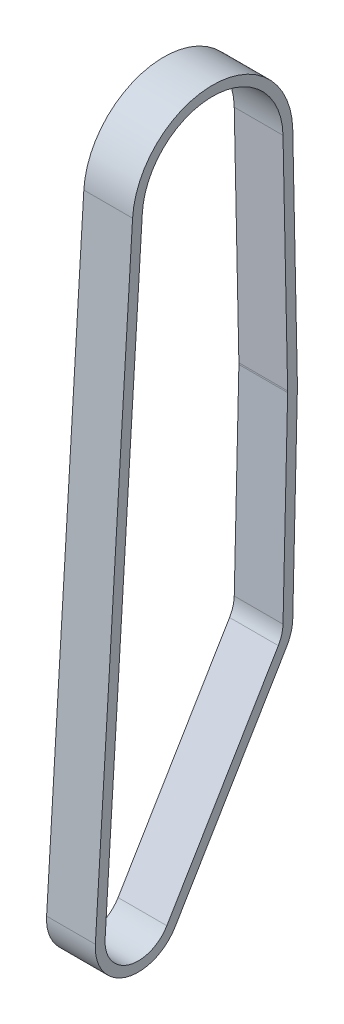
ISO-10303-21;
HEADER;
FILE_DESCRIPTION(('STEP AP214'),'2;1');
FILE_NAME('part.step','',(''),(''),'','','');
FILE_SCHEMA(('AUTOMOTIVE_DESIGN { 1 0 10303 214 1 1 1 1 }'));
ENDSEC;
DATA;
#1=APPLICATION_CONTEXT('core data for automotive mechanical design processes');
#2=APPLICATION_PROTOCOL_DEFINITION('international standard','automotive_design',2000,#1);
#3=PRODUCT_CONTEXT('',#1,'mechanical');
#4=PRODUCT('Part','Part','',(#3));
#5=PRODUCT_RELATED_PRODUCT_CATEGORY('part','',(#4));
#6=PRODUCT_DEFINITION_FORMATION('','',#4);
#7=PRODUCT_DEFINITION_CONTEXT('part definition',#1,'design');
#8=PRODUCT_DEFINITION('design','',#6,#7);
#9=PRODUCT_DEFINITION_SHAPE('','',#8);
#10=(LENGTH_UNIT() NAMED_UNIT(*) SI_UNIT(.MILLI.,.METRE.));
#11=(NAMED_UNIT(*) PLANE_ANGLE_UNIT() SI_UNIT($,.RADIAN.));
#12=(NAMED_UNIT(*) SI_UNIT($,.STERADIAN.) SOLID_ANGLE_UNIT());
#13=UNCERTAINTY_MEASURE_WITH_UNIT(LENGTH_MEASURE(1.E-05),#10,'distance_accuracy_value','');
#14=(GEOMETRIC_REPRESENTATION_CONTEXT(3) GLOBAL_UNCERTAINTY_ASSIGNED_CONTEXT((#13)) GLOBAL_UNIT_ASSIGNED_CONTEXT((#10,
#11,#12)) REPRESENTATION_CONTEXT('',''));
#15=CARTESIAN_POINT('',(0.,0.,0.));
#16=DIRECTION('',(0.,0.,1.));
#17=DIRECTION('',(1.,0.,0.));
#18=AXIS2_PLACEMENT_3D('',#15,#16,#17);
#19=CARTESIAN_POINT('',(-24.9999999999,-228.6,-42.8625));
#20=DIRECTION('',(1.,0.,0.));
#21=DIRECTION('',(0.,0.,-1.));
#22=AXIS2_PLACEMENT_3D('',#19,#20,#21);
#23=CYLINDRICAL_SURFACE('',#22,34.1000000038004);
#24=DIRECTION('',(1.,0.,0.));
#25=VECTOR('',#24,1.);
#26=CARTESIAN_POINT('',(0.,-227.890965629635,-76.9551277901269));
#27=LINE('',#26,#25);
#28=CARTESIAN_POINT('',(24.9999999999,-227.890965625989,-76.9551277956901));
#29=VERTEX_POINT('',#28);
#30=CARTESIAN_POINT('',(-24.9999999999,-227.890965625989,-76.9551277956901));
#31=VERTEX_POINT('',#30);
#32=EDGE_CURVE('E141',#29,#31,#27,.F.);
#33=ORIENTED_EDGE('',*,*,#32,.T.);
#34=CARTESIAN_POINT('',(-24.9999999999,-228.6,-42.8625));
#35=DIRECTION('',(1.,0.,0.));
#36=DIRECTION('',(0.,0.,-1.));
#37=AXIS2_PLACEMENT_3D('',#34,#35,#36);
#38=CIRCLE('',#37,34.1000000038004);
#39=CARTESIAN_POINT('',(-24.9999999999,-229.398999322011,-76.9531380059015));
#40=VERTEX_POINT('',#39);
#41=EDGE_CURVE('E20',#40,#31,#38,.T.);
#42=ORIENTED_EDGE('',*,*,#41,.F.);
#43=DIRECTION('',(1.,0.,0.));
#44=VECTOR('',#43,1.);
#45=CARTESIAN_POINT('',(0.,-229.398999315924,-76.9531379958773));
#46=LINE('',#45,#44);
#47=CARTESIAN_POINT('',(24.9999999999,-229.398999322011,-76.9531380059015));
#48=VERTEX_POINT('',#47);
#49=EDGE_CURVE('E210',#40,#48,#46,.T.);
#50=ORIENTED_EDGE('',*,*,#49,.T.);
#51=CARTESIAN_POINT('',(24.9999999999,-228.6,-42.8625));
#52=DIRECTION('',(1.,0.,0.));
#53=DIRECTION('',(0.,0.,-1.));
#54=AXIS2_PLACEMENT_3D('',#51,#52,#53);
#55=CIRCLE('',#54,34.1000000038004);
#56=EDGE_CURVE('E139',#29,#48,#55,.F.);
#57=ORIENTED_EDGE('',*,*,#56,.F.);
#58=EDGE_LOOP('',(#33,#42,#50,#57));
#59=FACE_BOUND('',#58,.T.);
#60=ADVANCED_FACE('F17',(#59),#23,.F.);
#61=CARTESIAN_POINT('',(0.,-152.741282902027,-255.971939979295));
#62=DIRECTION('',(0.,0.512417519703643,0.858736447055071));
#63=DIRECTION('',(0.,-0.858736447055071,0.512417519703643));
#64=AXIS2_PLACEMENT_3D('',#61,#62,#63);
#65=PLANE('',#64);
#66=DIRECTION('',(-1.,0.,0.));
#67=VECTOR('',#66,1.);
#68=CARTESIAN_POINT('',(0.,-645.947612581586,38.3297227075071));
#69=LINE('',#68,#67);
#70=CARTESIAN_POINT('',(24.9999999999,-645.947612576396,38.3297226857596));
#71=VERTEX_POINT('',#70);
#72=CARTESIAN_POINT('',(-24.9999999999,-645.947612576396,38.3297226857596));
#73=VERTEX_POINT('',#72);
#74=EDGE_CURVE('E219',#71,#73,#69,.T.);
#75=ORIENTED_EDGE('',*,*,#74,.T.);
#76=DIRECTION('',(0.,0.858736446976951,-0.51241751983456));
#77=VECTOR('',#76,1.);
#78=CARTESIAN_POINT('',(-25.,-645.947612598,38.32972268));
#79=LINE('',#78,#77);
#80=CARTESIAN_POINT('',(-24.99999999995,-454.397612652603,-75.9702773279939));
#81=VERTEX_POINT('',#80);
#82=EDGE_CURVE('E163',#73,#81,#79,.T.);
#83=ORIENTED_EDGE('',*,*,#82,.T.);
#84=DIRECTION('',(1.,0.,0.));
#85=VECTOR('',#84,1.);
#86=CARTESIAN_POINT('',(0.,-454.397612666,-75.97027732));
#87=LINE('',#86,#85);
#88=CARTESIAN_POINT('',(24.99999999995,-454.397612652603,-75.9702773279939));
#89=VERTEX_POINT('',#88);
#90=EDGE_CURVE('E217',#81,#89,#87,.T.);
#91=ORIENTED_EDGE('',*,*,#90,.T.);
#92=DIRECTION('',(0.,-0.858736446976951,0.51241751983456));
#93=VECTOR('',#92,1.);
#94=CARTESIAN_POINT('',(25.,-454.397612666,-75.97027732));
#95=LINE('',#94,#93);
#96=EDGE_CURVE('E186',#89,#71,#95,.T.);
#97=ORIENTED_EDGE('',*,*,#96,.T.);
#98=EDGE_LOOP('',(#75,#83,#91,#97));
#99=FACE_BOUND('',#98,.T.);
#100=ADVANCED_FACE('F419',(#99),#65,.F.);
#101=CARTESIAN_POINT('',(-24.9999999999,-431.8,-38.1));
#102=DIRECTION('',(1.,0.,0.));
#103=DIRECTION('',(0.,0.,-1.));
#104=AXIS2_PLACEMENT_3D('',#101,#102,#103);
#105=CYLINDRICAL_SURFACE('',#104,44.1000000283024);
#106=CARTESIAN_POINT('',(-24.9999999999,-431.8,-38.1));
#107=DIRECTION('',(1.,0.,0.));
#108=DIRECTION('',(0.,0.,-1.));
#109=AXIS2_PLACEMENT_3D('',#106,#107,#108);
#110=CIRCLE('',#109,44.1000000283024);
#111=CARTESIAN_POINT('',(-24.9999999999,-432.833310040429,-82.1878925574647));
#112=VERTEX_POINT('',#111);
#113=EDGE_CURVE('E162',#81,#112,#110,.T.);
#114=ORIENTED_EDGE('',*,*,#113,.T.);
#115=DIRECTION('',(1.,0.,0.));
#116=VECTOR('',#115,1.);
#117=CARTESIAN_POINT('',(0.,-432.83331009931,-82.1878925413531));
#118=LINE('',#117,#116);
#119=CARTESIAN_POINT('',(24.9999999999,-432.833310040429,-82.1878925574647));
#120=VERTEX_POINT('',#119);
#121=EDGE_CURVE('E215',#112,#120,#118,.T.);
#122=ORIENTED_EDGE('',*,*,#121,.T.);
#123=CARTESIAN_POINT('',(24.9999999999,-431.8,-38.1));
#124=DIRECTION('',(1.,0.,0.));
#125=DIRECTION('',(0.,0.,-1.));
#126=AXIS2_PLACEMENT_3D('',#123,#124,#125);
#127=CIRCLE('',#126,44.1000000283024);
#128=EDGE_CURVE('E188',#120,#89,#127,.F.);
#129=ORIENTED_EDGE('',*,*,#128,.T.);
#130=ORIENTED_EDGE('',*,*,#90,.F.);
#131=EDGE_LOOP('',(#114,#122,#129,#130));
#132=FACE_BOUND('',#131,.T.);
#133=ADVANCED_FACE('F410',(#132),#105,.T.);
#134=CARTESIAN_POINT('',(0.,-2.16285307913382,-92.2817313776267));
#135=DIRECTION('',(0.,0.02343106534892,0.999725454900802));
#136=DIRECTION('',(0.,-0.999725454900802,0.02343106534892));
#137=AXIS2_PLACEMENT_3D('',#134,#135,#136);
#138=PLANE('',#137);
#139=ORIENTED_EDGE('',*,*,#121,.F.);
#140=DIRECTION('',(0.,0.999725454901137,-0.023431065334601));
#141=VECTOR('',#140,1.);
#142=CARTESIAN_POINT('',(-25.,-432.8333101,-82.1878925708));
#143=LINE('',#142,#141);
#144=CARTESIAN_POINT('',(-24.99999999995,-229.633309977239,-86.9503925707007));
#145=VERTEX_POINT('',#144);
#146=EDGE_CURVE('E160',#112,#145,#143,.T.);
#147=ORIENTED_EDGE('',*,*,#146,.T.);
#148=DIRECTION('',(1.,0.,0.));
#149=VECTOR('',#148,1.);
#150=CARTESIAN_POINT('',(0.,-229.633309973,-86.9503925708));
#151=LINE('',#150,#149);
#152=CARTESIAN_POINT('',(24.99999999995,-229.633309977239,-86.9503925707007));
#153=VERTEX_POINT('',#152);
#154=EDGE_CURVE('E146',#145,#153,#151,.T.);
#155=ORIENTED_EDGE('',*,*,#154,.T.);
#156=DIRECTION('',(0.,-0.999725454901137,0.023431065334601));
#157=VECTOR('',#156,1.);
#158=CARTESIAN_POINT('',(25.,-229.633309973,-86.9503925708));
#159=LINE('',#158,#157);
#160=EDGE_CURVE('E189',#153,#120,#159,.T.);
#161=ORIENTED_EDGE('',*,*,#160,.T.);
#162=EDGE_LOOP('',(#139,#147,#155,#161));
#163=FACE_BOUND('',#162,.T.);
#164=ADVANCED_FACE('F283',(#163),#138,.F.);
#165=CARTESIAN_POINT('',(-24.9999999999,-228.6,-42.8625));
#166=DIRECTION('',(1.,0.,0.));
#167=DIRECTION('',(0.,0.,-1.));
#168=AXIS2_PLACEMENT_3D('',#165,#166,#167);
#169=CYLINDRICAL_SURFACE('',#168,44.1000000094638);
#170=CARTESIAN_POINT('',(-24.9999999999,-228.6,-42.8625));
#171=DIRECTION('',(1.,0.,0.));
#172=DIRECTION('',(0.,0.,-1.));
#173=AXIS2_PLACEMENT_3D('',#170,#171,#172);
#174=CIRCLE('',#173,44.1000000094638);
#175=CARTESIAN_POINT('',(-24.9999999999,-227.683037647834,-86.9529658624214));
#176=VERTEX_POINT('',#175);
#177=EDGE_CURVE('E159',#145,#176,#174,.T.);
#178=ORIENTED_EDGE('',*,*,#177,.T.);
#179=DIRECTION('',(1.,0.,0.));
#180=VECTOR('',#179,1.);
#181=CARTESIAN_POINT('',(0.,-227.683037648323,-86.9529658546564));
#182=LINE('',#181,#180);
#183=CARTESIAN_POINT('',(24.9999999999,-227.683037647834,-86.9529658624214));
#184=VERTEX_POINT('',#183);
#185=EDGE_CURVE('E196',#176,#184,#182,.T.);
#186=ORIENTED_EDGE('',*,*,#185,.T.);
#187=CARTESIAN_POINT('',(24.9999999999,-228.6,-42.8625));
#188=DIRECTION('',(1.,0.,0.));
#189=DIRECTION('',(0.,0.,-1.));
#190=AXIS2_PLACEMENT_3D('',#187,#188,#189);
#191=CIRCLE('',#190,44.1000000094638);
#192=EDGE_CURVE('E192',#184,#153,#191,.F.);
#193=ORIENTED_EDGE('',*,*,#192,.T.);
#194=ORIENTED_EDGE('',*,*,#154,.F.);
#195=EDGE_LOOP('',(#178,#186,#193,#194));
#196=FACE_BOUND('',#195,.T.);
#197=ADVANCED_FACE('F275',(#196),#169,.T.);
#198=CARTESIAN_POINT('',(-24.9999999999,0.,0.));
#199=DIRECTION('',(1.,0.,0.));
#200=DIRECTION('',(0.,0.,-1.));
#201=AXIS2_PLACEMENT_3D('',#198,#199,#200);
#202=CYLINDRICAL_SURFACE('',#201,72.2000000114534);
#203=DIRECTION('',(1.,0.,0.));
#204=VECTOR('',#203,1.);
#205=CARTESIAN_POINT('',(0.,4.39658313684081,72.0660117923846));
#206=LINE('',#205,#204);
#207=CARTESIAN_POINT('',(24.9999999999,4.3965831371889,72.0660117954826));
#208=VERTEX_POINT('',#207);
#209=CARTESIAN_POINT('',(-24.9999999999,4.3965831371889,72.0660117954826));
#210=VERTEX_POINT('',#209);
#211=EDGE_CURVE('E202',#208,#210,#206,.F.);
#212=ORIENTED_EDGE('',*,*,#211,.T.);
#213=CARTESIAN_POINT('',(-24.9999999999,0.,0.));
#214=DIRECTION('',(1.,0.,0.));
#215=DIRECTION('',(0.,0.,-1.));
#216=AXIS2_PLACEMENT_3D('',#213,#214,#215);
#217=CIRCLE('',#216,72.2000000114534);
#218=CARTESIAN_POINT('',(-24.9999999999,1.50123994461374,-72.1843908250516));
#219=VERTEX_POINT('',#218);
#220=EDGE_CURVE('E150',#210,#219,#217,.F.);
#221=ORIENTED_EDGE('',*,*,#220,.T.);
#222=DIRECTION('',(1.,0.,0.));
#223=VECTOR('',#222,1.);
#224=CARTESIAN_POINT('',(0.,1.50123994577437,-72.1843908146459));
#225=LINE('',#224,#223);
#226=CARTESIAN_POINT('',(24.9999999999,1.50123994461374,-72.1843908250516));
#227=VERTEX_POINT('',#226);
#228=EDGE_CURVE('E145',#219,#227,#225,.T.);
#229=ORIENTED_EDGE('',*,*,#228,.T.);
#230=CARTESIAN_POINT('',(24.9999999999,0.,0.));
#231=DIRECTION('',(1.,0.,0.));
#232=DIRECTION('',(0.,0.,-1.));
#233=AXIS2_PLACEMENT_3D('',#230,#231,#232);
#234=CIRCLE('',#233,72.2000000114534);
#235=EDGE_CURVE('E174',#227,#208,#234,.T.);
#236=ORIENTED_EDGE('',*,*,#235,.T.);
#237=EDGE_LOOP('',(#212,#221,#229,#236));
#238=FACE_BOUND('',#237,.T.);
#239=ADVANCED_FACE('F272',(#238),#202,.F.);
#240=CARTESIAN_POINT('',(0.,1.50123994600494,-72.1843908146411));
#241=DIRECTION('',(0.,-0.0207927970387593,0.999783806425822));
#242=DIRECTION('',(0.,-0.999783806425822,-0.0207927970387593));
#243=AXIS2_PLACEMENT_3D('',#240,#241,#242);
#244=PLANE('',#243);
#245=DIRECTION('',(0.,-0.999783806426681,-0.0207927969974372));
#246=VECTOR('',#245,1.);
#247=CARTESIAN_POINT('',(-25.,1.501239946206,-72.1843908354));
#248=LINE('',#247,#246);
#249=EDGE_CURVE('E136',#219,#31,#248,.T.);
#250=ORIENTED_EDGE('',*,*,#249,.T.);
#251=ORIENTED_EDGE('',*,*,#32,.F.);
#252=DIRECTION('',(0.,0.999783806426681,0.0207927969974372));
#253=VECTOR('',#252,1.);
#254=CARTESIAN_POINT('',(25.,-227.8909656294,-76.9551278014));
#255=LINE('',#254,#253);
#256=EDGE_CURVE('E172',#29,#227,#255,.T.);
#257=ORIENTED_EDGE('',*,*,#256,.T.);
#258=ORIENTED_EDGE('',*,*,#228,.F.);
#259=EDGE_LOOP('',(#250,#251,#257,#258));
#260=FACE_BOUND('',#259,.T.);
#261=ADVANCED_FACE('F149',(#260),#244,.T.);
#262=CARTESIAN_POINT('',(0.,-1.92854242565755,-82.2844768291706));
#263=DIRECTION('',(0.,0.02343106534892,0.999725454900802));
#264=DIRECTION('',(0.,-0.999725454900802,0.02343106534892));
#265=AXIS2_PLACEMENT_3D('',#262,#263,#264);
#266=PLANE('',#265);
#267=DIRECTION('',(0.,-0.999725454901069,0.0234310653375282));
#268=VECTOR('',#267,1.);
#269=CARTESIAN_POINT('',(-25.,-229.3989993164,-76.9531380162));
#270=LINE('',#269,#268);
#271=CARTESIAN_POINT('',(-24.9999999999,-432.598999373327,-72.19063802792));
#272=VERTEX_POINT('',#271);
#273=EDGE_CURVE('E138',#40,#272,#270,.T.);
#274=ORIENTED_EDGE('',*,*,#273,.T.);
#275=DIRECTION('',(-1.,0.,0.));
#276=VECTOR('',#275,1.);
#277=CARTESIAN_POINT('',(0.,-432.5989994185,-72.1906380375343));
#278=LINE('',#277,#276);
#279=CARTESIAN_POINT('',(24.9999999999,-432.598999373327,-72.19063802792));
#280=VERTEX_POINT('',#279);
#281=EDGE_CURVE('E208',#272,#280,#278,.F.);
#282=ORIENTED_EDGE('',*,*,#281,.T.);
#283=DIRECTION('',(0.,0.999725454901069,-0.0234310653375282));
#284=VECTOR('',#283,1.);
#285=CARTESIAN_POINT('',(25.,-432.598999418,-72.1906380162));
#286=LINE('',#285,#284);
#287=EDGE_CURVE('E175',#280,#48,#286,.T.);
#288=ORIENTED_EDGE('',*,*,#287,.T.);
#289=ORIENTED_EDGE('',*,*,#49,.F.);
#290=EDGE_LOOP('',(#274,#282,#288,#289));
#291=FACE_BOUND('',#290,.T.);
#292=ADVANCED_FACE('F252',(#291),#266,.T.);
#293=CARTESIAN_POINT('',(-24.9999999999,-431.8,-38.1));
#294=DIRECTION('',(1.,0.,0.));
#295=DIRECTION('',(0.,0.,-1.));
#296=AXIS2_PLACEMENT_3D('',#293,#294,#295);
#297=CYLINDRICAL_SURFACE('',#296,34.1000000275212);
#298=ORIENTED_EDGE('',*,*,#281,.F.);
#299=CARTESIAN_POINT('',(-24.9999999999,-431.8,-38.1));
#300=DIRECTION('',(1.,0.,0.));
#301=DIRECTION('',(0.,0.,-1.));
#302=AXIS2_PLACEMENT_3D('',#299,#300,#301);
#303=CIRCLE('',#302,34.1000000275212);
#304=CARTESIAN_POINT('',(-24.9999999999,-449.273437456219,-67.3829128311194));
#305=VERTEX_POINT('',#304);
#306=EDGE_CURVE('E152',#272,#305,#303,.F.);
#307=ORIENTED_EDGE('',*,*,#306,.T.);
#308=DIRECTION('',(1.,0.,0.));
#309=VECTOR('',#308,1.);
#310=CARTESIAN_POINT('',(0.,-449.273437471976,-67.3829127966913));
#311=LINE('',#310,#309);
#312=CARTESIAN_POINT('',(24.9999999999,-449.273437456219,-67.3829128311194));
#313=VERTEX_POINT('',#312);
#314=EDGE_CURVE('E206',#305,#313,#311,.T.);
#315=ORIENTED_EDGE('',*,*,#314,.T.);
#316=CARTESIAN_POINT('',(24.9999999999,-431.8,-38.1));
#317=DIRECTION('',(1.,0.,0.));
#318=DIRECTION('',(0.,0.,-1.));
#319=AXIS2_PLACEMENT_3D('',#316,#317,#318);
#320=CIRCLE('',#319,34.1000000275212);
#321=EDGE_CURVE('E178',#313,#280,#320,.T.);
#322=ORIENTED_EDGE('',*,*,#321,.T.);
#323=EDGE_LOOP('',(#298,#307,#315,#322));
#324=FACE_BOUND('',#323,.T.);
#325=ADVANCED_FACE('F255',(#324),#297,.F.);
#326=CARTESIAN_POINT('',(0.,-147.617107705375,-247.384575509388));
#327=DIRECTION('',(0.,0.512417519703643,0.858736447055071));
#328=DIRECTION('',(0.,-0.858736447055071,0.512417519703643));
#329=AXIS2_PLACEMENT_3D('',#326,#327,#328);
#330=PLANE('',#329);
#331=DIRECTION('',(0.,-0.858736446976951,0.51241751983456));
#332=VECTOR('',#331,1.);
#333=CARTESIAN_POINT('',(-25.,-449.273437494,-67.3829128336));
#334=LINE('',#333,#332);
#335=CARTESIAN_POINT('',(-24.9999999999,-640.823437389729,46.9170871663495));
#336=VERTEX_POINT('',#335);
#337=EDGE_CURVE('E228',#305,#336,#334,.T.);
#338=ORIENTED_EDGE('',*,*,#337,.T.);
#339=DIRECTION('',(-1.,0.,0.));
#340=VECTOR('',#339,1.);
#341=CARTESIAN_POINT('',(0.,-640.823437406997,46.9170871982465));
#342=LINE('',#341,#340);
#343=CARTESIAN_POINT('',(24.9999999999,-640.823437389729,46.9170871663495));
#344=VERTEX_POINT('',#343);
#345=EDGE_CURVE('E204',#336,#344,#342,.F.);
#346=ORIENTED_EDGE('',*,*,#345,.T.);
#347=DIRECTION('',(0.,0.858736446976951,-0.51241751983456));
#348=VECTOR('',#347,1.);
#349=CARTESIAN_POINT('',(25.,-640.823437426,46.9170871664));
#350=LINE('',#349,#348);
#351=EDGE_CURVE('E179',#344,#313,#350,.T.);
#352=ORIENTED_EDGE('',*,*,#351,.T.);
#353=ORIENTED_EDGE('',*,*,#314,.F.);
#354=EDGE_LOOP('',(#338,#346,#352,#353));
#355=FACE_BOUND('',#354,.T.);
#356=ADVANCED_FACE('F261',(#355),#330,.T.);
#357=CARTESIAN_POINT('',(-24.9999999999,-623.349999932,76.2));
#358=DIRECTION('',(1.,0.,0.));
#359=DIRECTION('',(0.,0.,-1.));
#360=AXIS2_PLACEMENT_3D('',#357,#358,#359);
#361=CYLINDRICAL_SURFACE('',#360,34.0999999904358);
#362=ORIENTED_EDGE('',*,*,#345,.F.);
#363=CARTESIAN_POINT('',(-24.9999999999,-623.349999932,76.2));
#364=DIRECTION('',(1.,0.,0.));
#365=DIRECTION('',(0.,0.,-1.));
#366=AXIS2_PLACEMENT_3D('',#363,#364,#365);
#367=CIRCLE('',#366,34.0999999904358);
#368=CARTESIAN_POINT('',(-24.9999999999,-621.273497361988,110.23671747746));
#369=VERTEX_POINT('',#368);
#370=EDGE_CURVE('E226',#336,#369,#367,.F.);
#371=ORIENTED_EDGE('',*,*,#370,.T.);
#372=DIRECTION('',(1.,0.,0.));
#373=VECTOR('',#372,1.);
#374=CARTESIAN_POINT('',(0.,-621.273497353614,110.236717480122));
#375=LINE('',#374,#373);
#376=CARTESIAN_POINT('',(24.9999999999,-621.273497361988,110.23671747746));
#377=VERTEX_POINT('',#376);
#378=EDGE_CURVE('E200',#369,#377,#375,.T.);
#379=ORIENTED_EDGE('',*,*,#378,.T.);
#380=CARTESIAN_POINT('',(24.9999999999,-623.349999932,76.2));
#381=DIRECTION('',(1.,0.,0.));
#382=DIRECTION('',(0.,0.,-1.));
#383=AXIS2_PLACEMENT_3D('',#380,#381,#382);
#384=CIRCLE('',#383,34.0999999904358);
#385=EDGE_CURVE('E182',#377,#344,#384,.T.);
#386=ORIENTED_EDGE('',*,*,#385,.T.);
#387=EDGE_LOOP('',(#362,#371,#379,#386));
#388=FACE_BOUND('',#387,.T.);
#389=ADVANCED_FACE('F265',(#388),#361,.F.);
#390=CARTESIAN_POINT('',(0.,4.39658313860188,72.0660117922771));
#391=DIRECTION('',(0.,0.0608945033109307,0.998144207750821));
#392=DIRECTION('',(0.,-0.998144207750821,0.0608945033109307));
#393=AXIS2_PLACEMENT_3D('',#390,#391,#392);
#394=PLANE('',#393);
#395=ORIENTED_EDGE('',*,*,#378,.F.);
#396=DIRECTION('',(0.,0.998144207752042,-0.0608945032909297));
#397=VECTOR('',#396,1.);
#398=CARTESIAN_POINT('',(-25.,-621.273497354,110.2367174738));
#399=LINE('',#398,#397);
#400=EDGE_CURVE('E225',#369,#210,#399,.T.);
#401=ORIENTED_EDGE('',*,*,#400,.T.);
#402=ORIENTED_EDGE('',*,*,#211,.F.);
#403=DIRECTION('',(0.,-0.998144207752042,0.0608945032909297));
#404=VECTOR('',#403,1.);
#405=CARTESIAN_POINT('',(25.,4.39658313722,72.0660117986));
#406=LINE('',#405,#404);
#407=EDGE_CURVE('E183',#208,#377,#406,.T.);
#408=ORIENTED_EDGE('',*,*,#407,.T.);
#409=EDGE_LOOP('',(#395,#401,#402,#408));
#410=FACE_BOUND('',#409,.T.);
#411=ADVANCED_FACE('F270',(#410),#394,.F.);
#412=CARTESIAN_POINT('',(0.,1.7091679164029,-82.1822288793976));
#413=DIRECTION('',(0.,-0.0207927970387593,0.999783806425822));
#414=DIRECTION('',(0.,-0.999783806425822,-0.0207927970387593));
#415=AXIS2_PLACEMENT_3D('',#412,#413,#414);
#416=PLANE('',#415);
#417=ORIENTED_EDGE('',*,*,#185,.F.);
#418=DIRECTION('',(0.,0.999783806424359,0.0207927971091053));
#419=VECTOR('',#418,1.);
#420=CARTESIAN_POINT('',(-25.,-227.683037648,-86.9529658702));
#421=LINE('',#420,#419);
#422=CARTESIAN_POINT('',(-24.99999999995,1.70916791930145,-82.1822288787403));
#423=VERTEX_POINT('',#422);
#424=EDGE_CURVE('E154',#176,#423,#421,.T.);
#425=ORIENTED_EDGE('',*,*,#424,.T.);
#426=DIRECTION('',(1.,0.,0.));
#427=VECTOR('',#426,1.);
#428=CARTESIAN_POINT('',(0.,1.70916791643,-82.1822288788));
#429=LINE('',#428,#427);
#430=CARTESIAN_POINT('',(24.99999999995,1.70916791930146,-82.1822288787403));
#431=VERTEX_POINT('',#430);
#432=EDGE_CURVE('E171',#423,#431,#429,.T.);
#433=ORIENTED_EDGE('',*,*,#432,.T.);
#434=DIRECTION('',(0.,-0.999783806424359,-0.0207927971091053));
#435=VECTOR('',#434,1.);
#436=CARTESIAN_POINT('',(25.,1.70916791643,-82.1822288788));
#437=LINE('',#436,#435);
#438=EDGE_CURVE('E193',#431,#184,#437,.T.);
#439=ORIENTED_EDGE('',*,*,#438,.T.);
#440=EDGE_LOOP('',(#417,#425,#433,#439));
#441=FACE_BOUND('',#440,.T.);
#442=ADVANCED_FACE('F305',(#441),#416,.F.);
#443=CARTESIAN_POINT('',(25.,0.,0.));
#444=DIRECTION('',(1.,0.,0.));
#445=DIRECTION('',(0.,0.,-1.));
#446=AXIS2_PLACEMENT_3D('',#443,#444,#445);
#447=PLANE('',#446);
#448=ORIENTED_EDGE('',*,*,#256,.F.);
#449=ORIENTED_EDGE('',*,*,#56,.T.);
#450=ORIENTED_EDGE('',*,*,#287,.F.);
#451=ORIENTED_EDGE('',*,*,#321,.F.);
#452=ORIENTED_EDGE('',*,*,#351,.F.);
#453=ORIENTED_EDGE('',*,*,#385,.F.);
#454=ORIENTED_EDGE('',*,*,#407,.F.);
#455=ORIENTED_EDGE('',*,*,#235,.F.);
#456=EDGE_LOOP('',(#448,#449,#450,#451,#452,#453,#454,#455));
#457=FACE_BOUND('',#456,.T.);
#458=CARTESIAN_POINT('',(24.9999999999,-623.349999932,76.2));
#459=DIRECTION('',(1.,0.,0.));
#460=DIRECTION('',(0.,0.,-1.));
#461=AXIS2_PLACEMENT_3D('',#458,#459,#460);
#462=CIRCLE('',#461,44.0999999962703);
#463=CARTESIAN_POINT('',(24.9999999999,-620.66455237803,120.218159561911));
#464=VERTEX_POINT('',#463);
#465=EDGE_CURVE('E221',#464,#71,#462,.T.);
#466=ORIENTED_EDGE('',*,*,#465,.T.);
#467=ORIENTED_EDGE('',*,*,#96,.F.);
#468=ORIENTED_EDGE('',*,*,#128,.F.);
#469=ORIENTED_EDGE('',*,*,#160,.F.);
#470=ORIENTED_EDGE('',*,*,#192,.F.);
#471=ORIENTED_EDGE('',*,*,#438,.F.);
#472=CARTESIAN_POINT('',(24.9999999999,0.,0.));
#473=DIRECTION('',(1.,0.,0.));
#474=DIRECTION('',(0.,0.,-1.));
#475=AXIS2_PLACEMENT_3D('',#472,#473,#474);
#476=CIRCLE('',#475,82.1999999905963);
#477=CARTESIAN_POINT('',(24.9999999999,5.00552817049156,82.0474538706309));
#478=VERTEX_POINT('',#477);
#479=EDGE_CURVE('E223',#431,#478,#476,.T.);
#480=ORIENTED_EDGE('',*,*,#479,.T.);
#481=DIRECTION('',(0.,-0.998144207750821,0.0608945033109307));
#482=VECTOR('',#481,1.);
#483=CARTESIAN_POINT('',(24.9999999999,5.00552817175806,82.0474538705536));
#484=LINE('',#483,#482);
#485=EDGE_CURVE('E168',#478,#464,#484,.T.);
#486=ORIENTED_EDGE('',*,*,#485,.T.);
#487=EDGE_LOOP('',(#466,#467,#468,#469,#470,#471,#480,#486));
#488=FACE_BOUND('',#487,.T.);
#489=ADVANCED_FACE('F247',(#457,#488),#447,.T.);
#490=CARTESIAN_POINT('',(-24.9999999999,-623.349999932,76.2));
#491=DIRECTION('',(1.,0.,0.));
#492=DIRECTION('',(0.,0.,-1.));
#493=AXIS2_PLACEMENT_3D('',#490,#491,#492);
#494=CYLINDRICAL_SURFACE('',#493,44.0999999962703);
#495=CARTESIAN_POINT('',(-24.9999999999,-623.349999932,76.2));
#496=DIRECTION('',(1.,0.,0.));
#497=DIRECTION('',(0.,0.,-1.));
#498=AXIS2_PLACEMENT_3D('',#495,#496,#497);
#499=CIRCLE('',#498,44.0999999962703);
#500=CARTESIAN_POINT('',(-24.9999999999,-620.66455237803,120.218159561911));
#501=VERTEX_POINT('',#500);
#502=EDGE_CURVE('E165',#501,#73,#499,.T.);
#503=ORIENTED_EDGE('',*,*,#502,.T.);
#504=ORIENTED_EDGE('',*,*,#74,.F.);
#505=ORIENTED_EDGE('',*,*,#465,.F.);
#506=DIRECTION('',(1.,0.,0.));
#507=VECTOR('',#506,1.);
#508=CARTESIAN_POINT('',(0.,-620.664552419923,120.218159564466));
#509=LINE('',#508,#507);
#510=EDGE_CURVE('E167',#464,#501,#509,.F.);
#511=ORIENTED_EDGE('',*,*,#510,.T.);
#512=EDGE_LOOP('',(#503,#504,#505,#511));
#513=FACE_BOUND('',#512,.T.);
#514=ADVANCED_FACE('F299',(#513),#494,.T.);
#515=CARTESIAN_POINT('',(-25.,0.,0.));
#516=DIRECTION('',(1.,0.,0.));
#517=DIRECTION('',(0.,0.,-1.));
#518=AXIS2_PLACEMENT_3D('',#515,#516,#517);
#519=PLANE('',#518);
#520=ORIENTED_EDGE('',*,*,#370,.F.);
#521=ORIENTED_EDGE('',*,*,#337,.F.);
#522=ORIENTED_EDGE('',*,*,#306,.F.);
#523=ORIENTED_EDGE('',*,*,#273,.F.);
#524=ORIENTED_EDGE('',*,*,#41,.T.);
#525=ORIENTED_EDGE('',*,*,#249,.F.);
#526=ORIENTED_EDGE('',*,*,#220,.F.);
#527=ORIENTED_EDGE('',*,*,#400,.F.);
#528=EDGE_LOOP('',(#520,#521,#522,#523,#524,#525,#526,#527));
#529=FACE_BOUND('',#528,.T.);
#530=ORIENTED_EDGE('',*,*,#424,.F.);
#531=ORIENTED_EDGE('',*,*,#177,.F.);
#532=ORIENTED_EDGE('',*,*,#146,.F.);
#533=ORIENTED_EDGE('',*,*,#113,.F.);
#534=ORIENTED_EDGE('',*,*,#82,.F.);
#535=ORIENTED_EDGE('',*,*,#502,.F.);
#536=DIRECTION('',(0.,-0.998144207750821,0.0608945033109307));
#537=VECTOR('',#536,1.);
#538=CARTESIAN_POINT('',(-24.9999999999,5.00552817175806,82.0474538705536));
#539=LINE('',#538,#537);
#540=CARTESIAN_POINT('',(-24.9999999999,5.00552817049156,82.0474538706309));
#541=VERTEX_POINT('',#540);
#542=EDGE_CURVE('E26',#501,#541,#539,.F.);
#543=ORIENTED_EDGE('',*,*,#542,.T.);
#544=CARTESIAN_POINT('',(-24.9999999999,0.,0.));
#545=DIRECTION('',(1.,0.,0.));
#546=DIRECTION('',(0.,0.,-1.));
#547=AXIS2_PLACEMENT_3D('',#544,#545,#546);
#548=CIRCLE('',#547,82.1999999905963);
#549=EDGE_CURVE('E199',#541,#423,#548,.F.);
#550=ORIENTED_EDGE('',*,*,#549,.T.);
#551=EDGE_LOOP('',(#530,#531,#532,#533,#534,#535,#543,#550));
#552=FACE_BOUND('',#551,.T.);
#553=ADVANCED_FACE('F133',(#529,#552),#519,.F.);
#554=CARTESIAN_POINT('',(-24.9999999999,0.,0.));
#555=DIRECTION('',(1.,0.,0.));
#556=DIRECTION('',(0.,0.,-1.));
#557=AXIS2_PLACEMENT_3D('',#554,#555,#556);
#558=CYLINDRICAL_SURFACE('',#557,82.1999999905963);
#559=ORIENTED_EDGE('',*,*,#549,.F.);
#560=DIRECTION('',(1.,0.,0.));
#561=VECTOR('',#560,1.);
#562=CARTESIAN_POINT('',(0.,5.00552816922507,82.0474538707082));
#563=LINE('',#562,#561);
#564=EDGE_CURVE('E11',#541,#478,#563,.T.);
#565=ORIENTED_EDGE('',*,*,#564,.T.);
#566=ORIENTED_EDGE('',*,*,#479,.F.);
#567=ORIENTED_EDGE('',*,*,#432,.F.);
#568=EDGE_LOOP('',(#559,#565,#566,#567));
#569=FACE_BOUND('',#568,.T.);
#570=ADVANCED_FACE('F288',(#569),#558,.T.);
#571=CARTESIAN_POINT('',(0.,5.00552817175806,82.0474538705536));
#572=DIRECTION('',(0.,0.0608945033109307,0.998144207750821));
#573=DIRECTION('',(0.,-0.998144207750821,0.0608945033109307));
#574=AXIS2_PLACEMENT_3D('',#571,#572,#573);
#575=PLANE('',#574);
#576=ORIENTED_EDGE('',*,*,#542,.F.);
#577=ORIENTED_EDGE('',*,*,#510,.F.);
#578=ORIENTED_EDGE('',*,*,#485,.F.);
#579=ORIENTED_EDGE('',*,*,#564,.F.);
#580=EDGE_LOOP('',(#576,#577,#578,#579));
#581=FACE_BOUND('',#580,.T.);
#582=ADVANCED_FACE('F286',(#581),#575,.T.);
#583=CLOSED_SHELL('',(#60,#100,#133,#164,#197,#239,#261,#292,#325,#356,#389,#411,#442,#489,#514,
#553,#570,#582));
#584=MANIFOLD_SOLID_BREP('B1',#583);
#585=ADVANCED_BREP_SHAPE_REPRESENTATION('',(#18,#584),#14);
#586=SHAPE_DEFINITION_REPRESENTATION(#9,#585);
ENDSEC;
END-ISO-10303-21;
